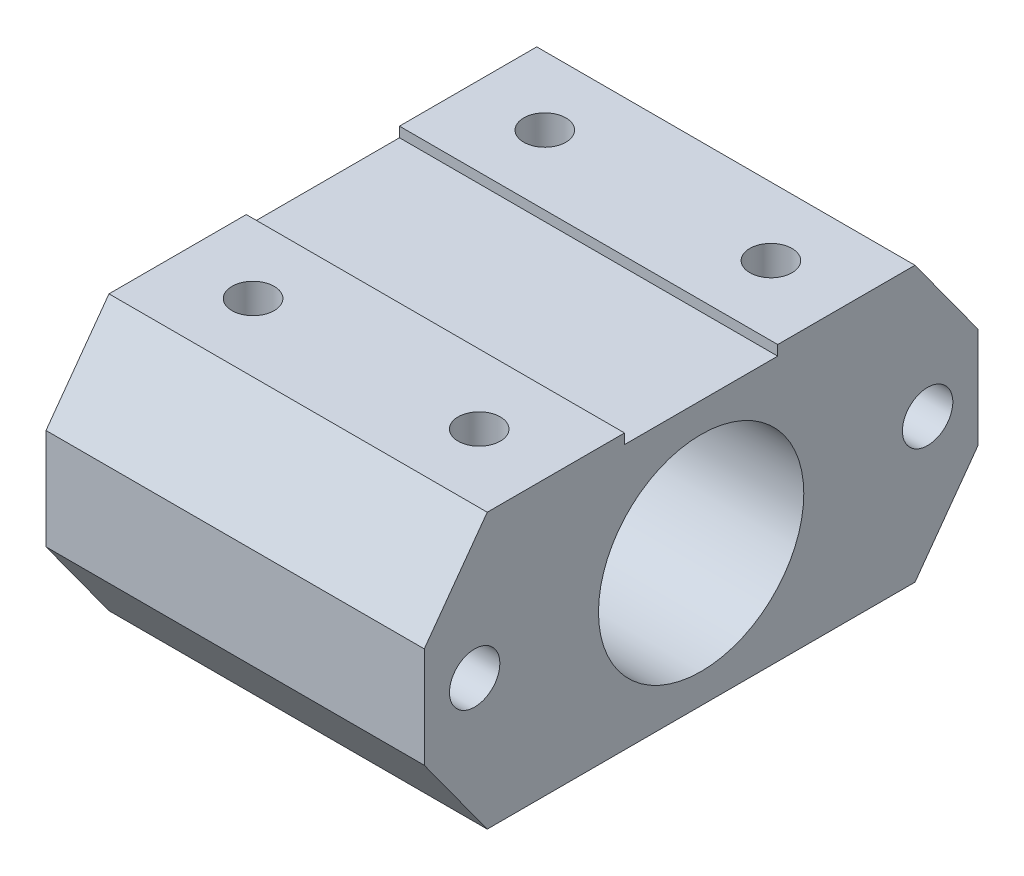
ISO-10303-21;
HEADER;
FILE_DESCRIPTION(('STEP AP214'),'2;1');
FILE_NAME('part.step','',(''),(''),'','','');
FILE_SCHEMA(('AUTOMOTIVE_DESIGN { 1 0 10303 214 1 1 1 1 }'));
ENDSEC;
DATA;
#1=APPLICATION_CONTEXT('core data for automotive mechanical design processes');
#2=APPLICATION_PROTOCOL_DEFINITION('international standard','automotive_design',2000,#1);
#3=PRODUCT_CONTEXT('',#1,'mechanical');
#4=PRODUCT('Part','Part','',(#3));
#5=PRODUCT_RELATED_PRODUCT_CATEGORY('part','',(#4));
#6=PRODUCT_DEFINITION_FORMATION('','',#4);
#7=PRODUCT_DEFINITION_CONTEXT('part definition',#1,'design');
#8=PRODUCT_DEFINITION('design','',#6,#7);
#9=PRODUCT_DEFINITION_SHAPE('','',#8);
#10=(LENGTH_UNIT() NAMED_UNIT(*) SI_UNIT(.MILLI.,.METRE.));
#11=(NAMED_UNIT(*) PLANE_ANGLE_UNIT() SI_UNIT($,.RADIAN.));
#12=(NAMED_UNIT(*) SI_UNIT($,.STERADIAN.) SOLID_ANGLE_UNIT());
#13=UNCERTAINTY_MEASURE_WITH_UNIT(LENGTH_MEASURE(1.E-05),#10,'distance_accuracy_value','');
#14=(GEOMETRIC_REPRESENTATION_CONTEXT(3) GLOBAL_UNCERTAINTY_ASSIGNED_CONTEXT((#13)) GLOBAL_UNIT_ASSIGNED_CONTEXT((#10,
#11,#12)) REPRESENTATION_CONTEXT('',''));
#15=CARTESIAN_POINT('',(0.,0.,0.));
#16=DIRECTION('',(0.,0.,1.));
#17=DIRECTION('',(1.,0.,0.));
#18=AXIS2_PLACEMENT_3D('',#15,#16,#17);
#19=CARTESIAN_POINT('',(0.,10.5,-16.98));
#20=DIRECTION('',(1.,0.,0.));
#21=DIRECTION('',(0.,0.,-1.));
#22=AXIS2_PLACEMENT_3D('',#19,#20,#21);
#23=CYLINDRICAL_SURFACE('',#22,8.15);
#24=CARTESIAN_POINT('',(30.03,10.5,-16.98));
#25=DIRECTION('',(1.,0.,0.));
#26=DIRECTION('',(0.,0.,-1.));
#27=AXIS2_PLACEMENT_3D('',#24,#25,#26);
#28=CIRCLE('',#27,8.15);
#29=CARTESIAN_POINT('',(30.03,10.5,-25.13));
#30=VERTEX_POINT('',#29);
#31=EDGE_CURVE('E216',#30,#30,#28,.T.);
#32=ORIENTED_EDGE('',*,*,#31,.T.);
#33=EDGE_LOOP('',(#32));
#34=FACE_BOUND('',#33,.T.);
#35=CARTESIAN_POINT('',(3.,10.5,-16.98));
#36=DIRECTION('',(-1.,0.,0.));
#37=DIRECTION('',(0.,0.,1.));
#38=AXIS2_PLACEMENT_3D('',#35,#36,#37);
#39=CIRCLE('',#38,8.15);
#40=CARTESIAN_POINT('',(3.,10.5,-8.83));
#41=VERTEX_POINT('',#40);
#42=EDGE_CURVE('E11',#41,#41,#39,.F.);
#43=ORIENTED_EDGE('',*,*,#42,.F.);
#44=EDGE_LOOP('',(#43));
#45=FACE_BOUND('',#44,.T.);
#46=ADVANCED_FACE('F37',(#34,#45),#23,.F.);
#47=CARTESIAN_POINT('',(0.,21.79,0.));
#48=DIRECTION('',(0.,-1.,0.));
#49=DIRECTION('',(0.,0.,-1.));
#50=AXIS2_PLACEMENT_3D('',#47,#48,#49);
#51=PLANE('',#50);
#52=CARTESIAN_POINT('',(6.04,21.79,-28.56));
#53=DIRECTION('',(0.,1.,0.));
#54=DIRECTION('',(0.,0.,-1.));
#55=AXIS2_PLACEMENT_3D('',#52,#53,#54);
#56=CIRCLE('',#55,1.675);
#57=CARTESIAN_POINT('',(6.04,21.79,-30.235));
#58=VERTEX_POINT('',#57);
#59=EDGE_CURVE('E238',#58,#58,#56,.T.);
#60=ORIENTED_EDGE('',*,*,#59,.F.);
#61=EDGE_LOOP('',(#60));
#62=FACE_BOUND('',#61,.T.);
#63=CARTESIAN_POINT('',(23.99,21.79,-28.56));
#64=DIRECTION('',(0.,1.,0.));
#65=DIRECTION('',(0.,0.,1.));
#66=AXIS2_PLACEMENT_3D('',#63,#64,#65);
#67=CIRCLE('',#66,1.675);
#68=CARTESIAN_POINT('',(23.99,21.79,-26.885));
#69=VERTEX_POINT('',#68);
#70=EDGE_CURVE('E144',#69,#69,#67,.T.);
#71=ORIENTED_EDGE('',*,*,#70,.F.);
#72=EDGE_LOOP('',(#71));
#73=FACE_BOUND('',#72,.T.);
#74=DIRECTION('',(0.,0.,1.));
#75=VECTOR('',#74,1.);
#76=CARTESIAN_POINT('',(0.,21.79,0.));
#77=LINE('',#76,#75);
#78=CARTESIAN_POINT('',(0.,21.79,-33.96));
#79=VERTEX_POINT('',#78);
#80=CARTESIAN_POINT('',(0.,21.79,-23.06));
#81=VERTEX_POINT('',#80);
#82=EDGE_CURVE('E248',#79,#81,#77,.T.);
#83=ORIENTED_EDGE('',*,*,#82,.T.);
#84=DIRECTION('',(-1.,0.,0.));
#85=VECTOR('',#84,1.);
#86=CARTESIAN_POINT('',(0.,21.79,-23.06));
#87=LINE('',#86,#85);
#88=CARTESIAN_POINT('',(30.03,21.79,-23.06));
#89=VERTEX_POINT('',#88);
#90=EDGE_CURVE('E203',#89,#81,#87,.T.);
#91=ORIENTED_EDGE('',*,*,#90,.F.);
#92=DIRECTION('',(0.,0.,-1.));
#93=VECTOR('',#92,1.);
#94=CARTESIAN_POINT('',(30.03,21.79,0.));
#95=LINE('',#94,#93);
#96=CARTESIAN_POINT('',(30.03,21.79,-33.96));
#97=VERTEX_POINT('',#96);
#98=EDGE_CURVE('E252',#89,#97,#95,.T.);
#99=ORIENTED_EDGE('',*,*,#98,.T.);
#100=DIRECTION('',(-1.,0.,0.));
#101=VECTOR('',#100,1.);
#102=CARTESIAN_POINT('',(0.,21.79,-33.96));
#103=LINE('',#102,#101);
#104=EDGE_CURVE('E45',#97,#79,#103,.T.);
#105=ORIENTED_EDGE('',*,*,#104,.T.);
#106=EDGE_LOOP('',(#83,#91,#99,#105));
#107=FACE_BOUND('',#106,.T.);
#108=ADVANCED_FACE('F303',(#62,#73,#107),#51,.F.);
#109=CARTESIAN_POINT('',(30.03,21.79,0.));
#110=VERTEX_POINT('',#109);
#111=CARTESIAN_POINT('',(30.03,21.79,-10.9));
#112=VERTEX_POINT('',#111);
#113=EDGE_CURVE('E253',#110,#112,#95,.T.);
#114=ORIENTED_EDGE('',*,*,#113,.T.);
#115=DIRECTION('',(1.,0.,0.));
#116=VECTOR('',#115,1.);
#117=CARTESIAN_POINT('',(0.,21.79,-10.9));
#118=LINE('',#117,#116);
#119=CARTESIAN_POINT('',(0.,21.79,-10.9));
#120=VERTEX_POINT('',#119);
#121=EDGE_CURVE('E198',#120,#112,#118,.T.);
#122=ORIENTED_EDGE('',*,*,#121,.F.);
#123=CARTESIAN_POINT('',(0.,21.79,0.));
#124=VERTEX_POINT('',#123);
#125=EDGE_CURVE('E84',#120,#124,#77,.T.);
#126=ORIENTED_EDGE('',*,*,#125,.T.);
#127=DIRECTION('',(1.,0.,0.));
#128=VECTOR('',#127,1.);
#129=CARTESIAN_POINT('',(0.,21.79,0.));
#130=LINE('',#129,#128);
#131=EDGE_CURVE('E250',#124,#110,#130,.T.);
#132=ORIENTED_EDGE('',*,*,#131,.T.);
#133=EDGE_LOOP('',(#114,#122,#126,#132));
#134=FACE_BOUND('',#133,.T.);
#135=CARTESIAN_POINT('',(23.99,21.79,-5.4));
#136=DIRECTION('',(0.,1.,0.));
#137=DIRECTION('',(0.,0.,-1.));
#138=AXIS2_PLACEMENT_3D('',#135,#136,#137);
#139=CIRCLE('',#138,1.675);
#140=CARTESIAN_POINT('',(23.99,21.79,-7.075));
#141=VERTEX_POINT('',#140);
#142=EDGE_CURVE('E232',#141,#141,#139,.T.);
#143=ORIENTED_EDGE('',*,*,#142,.F.);
#144=EDGE_LOOP('',(#143));
#145=FACE_BOUND('',#144,.T.);
#146=CARTESIAN_POINT('',(6.04,21.79,-5.4));
#147=DIRECTION('',(0.,1.,0.));
#148=DIRECTION('',(0.,0.,1.));
#149=AXIS2_PLACEMENT_3D('',#146,#147,#148);
#150=CIRCLE('',#149,1.675);
#151=CARTESIAN_POINT('',(6.04,21.79,-3.725));
#152=VERTEX_POINT('',#151);
#153=EDGE_CURVE('E226',#152,#152,#150,.T.);
#154=ORIENTED_EDGE('',*,*,#153,.F.);
#155=EDGE_LOOP('',(#154));
#156=FACE_BOUND('',#155,.T.);
#157=ADVANCED_FACE('F309',(#134,#145,#156),#51,.F.);
#158=CARTESIAN_POINT('',(0.,0.,0.));
#159=DIRECTION('',(0.,-1.,0.));
#160=DIRECTION('',(0.,0.,-1.));
#161=AXIS2_PLACEMENT_3D('',#158,#159,#160);
#162=PLANE('',#161);
#163=CARTESIAN_POINT('',(23.99,0.,-5.4));
#164=DIRECTION('',(0.,1.,0.));
#165=DIRECTION('',(0.,0.,-1.));
#166=AXIS2_PLACEMENT_3D('',#163,#164,#165);
#167=CIRCLE('',#166,1.675);
#168=CARTESIAN_POINT('',(23.99,0.,-7.075));
#169=VERTEX_POINT('',#168);
#170=EDGE_CURVE('E229',#169,#169,#167,.T.);
#171=ORIENTED_EDGE('',*,*,#170,.T.);
#172=EDGE_LOOP('',(#171));
#173=FACE_BOUND('',#172,.T.);
#174=CARTESIAN_POINT('',(23.99,0.,-28.56));
#175=DIRECTION('',(0.,1.,0.));
#176=DIRECTION('',(0.,0.,1.));
#177=AXIS2_PLACEMENT_3D('',#174,#175,#176);
#178=CIRCLE('',#177,1.675);
#179=CARTESIAN_POINT('',(23.99,0.,-26.885));
#180=VERTEX_POINT('',#179);
#181=EDGE_CURVE('E241',#180,#180,#178,.T.);
#182=ORIENTED_EDGE('',*,*,#181,.T.);
#183=EDGE_LOOP('',(#182));
#184=FACE_BOUND('',#183,.T.);
#185=DIRECTION('',(0.,0.,1.));
#186=VECTOR('',#185,1.);
#187=CARTESIAN_POINT('',(0.,0.,0.));
#188=LINE('',#187,#186);
#189=CARTESIAN_POINT('',(0.,0.,-33.96));
#190=VERTEX_POINT('',#189);
#191=CARTESIAN_POINT('',(0.,0.,0.));
#192=VERTEX_POINT('',#191);
#193=EDGE_CURVE('E76',#190,#192,#188,.T.);
#194=ORIENTED_EDGE('',*,*,#193,.F.);
#195=DIRECTION('',(-1.,0.,0.));
#196=VECTOR('',#195,1.);
#197=CARTESIAN_POINT('',(0.,0.,-33.96));
#198=LINE('',#197,#196);
#199=CARTESIAN_POINT('',(30.03,0.,-33.96));
#200=VERTEX_POINT('',#199);
#201=EDGE_CURVE('E257',#200,#190,#198,.T.);
#202=ORIENTED_EDGE('',*,*,#201,.F.);
#203=DIRECTION('',(0.,0.,-1.));
#204=VECTOR('',#203,1.);
#205=CARTESIAN_POINT('',(30.03,0.,0.));
#206=LINE('',#205,#204);
#207=CARTESIAN_POINT('',(30.03,0.,0.));
#208=VERTEX_POINT('',#207);
#209=EDGE_CURVE('E150',#208,#200,#206,.T.);
#210=ORIENTED_EDGE('',*,*,#209,.F.);
#211=DIRECTION('',(1.,0.,0.));
#212=VECTOR('',#211,1.);
#213=CARTESIAN_POINT('',(0.,0.,0.));
#214=LINE('',#213,#212);
#215=EDGE_CURVE('E143',#192,#208,#214,.T.);
#216=ORIENTED_EDGE('',*,*,#215,.F.);
#217=EDGE_LOOP('',(#194,#202,#210,#216));
#218=FACE_BOUND('',#217,.T.);
#219=CARTESIAN_POINT('',(6.04,0.,-28.56));
#220=DIRECTION('',(0.,1.,0.));
#221=DIRECTION('',(0.,0.,-1.));
#222=AXIS2_PLACEMENT_3D('',#219,#220,#221);
#223=CIRCLE('',#222,1.675);
#224=CARTESIAN_POINT('',(6.04,0.,-30.235));
#225=VERTEX_POINT('',#224);
#226=EDGE_CURVE('E235',#225,#225,#223,.T.);
#227=ORIENTED_EDGE('',*,*,#226,.T.);
#228=EDGE_LOOP('',(#227));
#229=FACE_BOUND('',#228,.T.);
#230=CARTESIAN_POINT('',(6.04,0.,-5.4));
#231=DIRECTION('',(0.,1.,0.));
#232=DIRECTION('',(0.,0.,1.));
#233=AXIS2_PLACEMENT_3D('',#230,#231,#232);
#234=CIRCLE('',#233,1.675);
#235=CARTESIAN_POINT('',(6.04,0.,-3.725));
#236=VERTEX_POINT('',#235);
#237=EDGE_CURVE('E225',#236,#236,#234,.T.);
#238=ORIENTED_EDGE('',*,*,#237,.T.);
#239=EDGE_LOOP('',(#238));
#240=FACE_BOUND('',#239,.T.);
#241=ADVANCED_FACE('F147',(#173,#184,#218,#229,#240),#162,.T.);
#242=CARTESIAN_POINT('',(0.,21.79,0.));
#243=DIRECTION('',(1.,0.,0.));
#244=DIRECTION('',(0.,0.,-1.));
#245=AXIS2_PLACEMENT_3D('',#242,#243,#244);
#246=PLANE('',#245);
#247=DIRECTION('',(0.,0.,1.));
#248=VECTOR('',#247,1.);
#249=CARTESIAN_POINT('',(0.,20.99,-23.06));
#250=LINE('',#249,#248);
#251=CARTESIAN_POINT('',(0.,20.99,-23.06));
#252=VERTEX_POINT('',#251);
#253=CARTESIAN_POINT('',(0.,20.99,-10.9));
#254=VERTEX_POINT('',#253);
#255=EDGE_CURVE('E201',#252,#254,#250,.T.);
#256=ORIENTED_EDGE('',*,*,#255,.F.);
#257=DIRECTION('',(0.,1.,0.));
#258=VECTOR('',#257,1.);
#259=CARTESIAN_POINT('',(0.,20.99,-23.06));
#260=LINE('',#259,#258);
#261=EDGE_CURVE('E213',#252,#81,#260,.T.);
#262=ORIENTED_EDGE('',*,*,#261,.T.);
#263=ORIENTED_EDGE('',*,*,#82,.F.);
#264=DIRECTION('',(0.,-0.809547668944308,-0.587054147167736));
#265=VECTOR('',#264,1.);
#266=CARTESIAN_POINT('',(0.,21.79,-33.96));
#267=LINE('',#266,#265);
#268=CARTESIAN_POINT('',(0.,14.895,-38.96));
#269=VERTEX_POINT('',#268);
#270=EDGE_CURVE('E183',#79,#269,#267,.T.);
#271=ORIENTED_EDGE('',*,*,#270,.T.);
#272=DIRECTION('',(0.,-1.,0.));
#273=VECTOR('',#272,1.);
#274=CARTESIAN_POINT('',(0.,14.895,-38.96));
#275=LINE('',#274,#273);
#276=CARTESIAN_POINT('',(0.,6.895,-38.96));
#277=VERTEX_POINT('',#276);
#278=EDGE_CURVE('E186',#269,#277,#275,.T.);
#279=ORIENTED_EDGE('',*,*,#278,.T.);
#280=DIRECTION('',(0.,-0.809547668944308,0.587054147167735));
#281=VECTOR('',#280,1.);
#282=CARTESIAN_POINT('',(0.,0.,-33.96));
#283=LINE('',#282,#281);
#284=EDGE_CURVE('E142',#277,#190,#283,.T.);
#285=ORIENTED_EDGE('',*,*,#284,.T.);
#286=ORIENTED_EDGE('',*,*,#193,.T.);
#287=DIRECTION('',(0.,0.809547668944308,0.587054147167735));
#288=VECTOR('',#287,1.);
#289=CARTESIAN_POINT('',(0.,6.895,5.));
#290=LINE('',#289,#288);
#291=CARTESIAN_POINT('',(0.,6.895,5.));
#292=VERTEX_POINT('',#291);
#293=EDGE_CURVE('E139',#192,#292,#290,.T.);
#294=ORIENTED_EDGE('',*,*,#293,.T.);
#295=DIRECTION('',(0.,1.,0.));
#296=VECTOR('',#295,1.);
#297=CARTESIAN_POINT('',(0.,14.895,5.));
#298=LINE('',#297,#296);
#299=CARTESIAN_POINT('',(0.,14.895,5.));
#300=VERTEX_POINT('',#299);
#301=EDGE_CURVE('E159',#292,#300,#298,.T.);
#302=ORIENTED_EDGE('',*,*,#301,.T.);
#303=DIRECTION('',(0.,0.809547668944308,-0.587054147167736));
#304=VECTOR('',#303,1.);
#305=CARTESIAN_POINT('',(0.,14.895,5.));
#306=LINE('',#305,#304);
#307=EDGE_CURVE('E162',#300,#124,#306,.T.);
#308=ORIENTED_EDGE('',*,*,#307,.T.);
#309=ORIENTED_EDGE('',*,*,#125,.F.);
#310=DIRECTION('',(0.,1.,0.));
#311=VECTOR('',#310,1.);
#312=CARTESIAN_POINT('',(0.,20.99,-10.9));
#313=LINE('',#312,#311);
#314=EDGE_CURVE('E210',#254,#120,#313,.T.);
#315=ORIENTED_EDGE('',*,*,#314,.F.);
#316=EDGE_LOOP('',(#256,#262,#263,#271,#279,#285,#286,#294,#302,#308,#309,#315));
#317=FACE_BOUND('',#316,.T.);
#318=CARTESIAN_POINT('',(0.,10.5,-16.98));
#319=DIRECTION('',(-1.,0.,0.));
#320=DIRECTION('',(0.,0.,1.));
#321=AXIS2_PLACEMENT_3D('',#318,#319,#320);
#322=CIRCLE('',#321,4.75);
#323=CARTESIAN_POINT('',(0.,10.5,-12.23));
#324=VERTEX_POINT('',#323);
#325=EDGE_CURVE('E194',#324,#324,#322,.T.);
#326=ORIENTED_EDGE('',*,*,#325,.F.);
#327=EDGE_LOOP('',(#326));
#328=FACE_BOUND('',#327,.T.);
#329=ADVANCED_FACE('F39',(#317,#328),#246,.F.);
#330=CARTESIAN_POINT('',(30.03,21.79,0.));
#331=DIRECTION('',(-1.,0.,0.));
#332=DIRECTION('',(0.,0.,1.));
#333=AXIS2_PLACEMENT_3D('',#330,#331,#332);
#334=PLANE('',#333);
#335=CARTESIAN_POINT('',(30.03,10.895,0.999999999999997));
#336=DIRECTION('',(1.,0.,0.));
#337=DIRECTION('',(0.,0.,-1.));
#338=AXIS2_PLACEMENT_3D('',#335,#336,#337);
#339=CIRCLE('',#338,2.);
#340=CARTESIAN_POINT('',(30.03,10.895,-1.));
#341=VERTEX_POINT('',#340);
#342=EDGE_CURVE('E165',#341,#341,#339,.T.);
#343=ORIENTED_EDGE('',*,*,#342,.F.);
#344=EDGE_LOOP('',(#343));
#345=FACE_BOUND('',#344,.T.);
#346=CARTESIAN_POINT('',(30.03,10.895,-34.96));
#347=DIRECTION('',(1.,0.,0.));
#348=DIRECTION('',(0.,0.,1.));
#349=AXIS2_PLACEMENT_3D('',#346,#347,#348);
#350=CIRCLE('',#349,2.);
#351=CARTESIAN_POINT('',(30.03,10.895,-32.96));
#352=VERTEX_POINT('',#351);
#353=EDGE_CURVE('E271',#352,#352,#350,.T.);
#354=ORIENTED_EDGE('',*,*,#353,.F.);
#355=EDGE_LOOP('',(#354));
#356=FACE_BOUND('',#355,.T.);
#357=ORIENTED_EDGE('',*,*,#98,.F.);
#358=DIRECTION('',(0.,1.,0.));
#359=VECTOR('',#358,1.);
#360=CARTESIAN_POINT('',(30.03,20.99,-23.06));
#361=LINE('',#360,#359);
#362=CARTESIAN_POINT('',(30.03,20.99,-23.06));
#363=VERTEX_POINT('',#362);
#364=EDGE_CURVE('E217',#363,#89,#361,.T.);
#365=ORIENTED_EDGE('',*,*,#364,.F.);
#366=DIRECTION('',(0.,0.,-1.));
#367=VECTOR('',#366,1.);
#368=CARTESIAN_POINT('',(30.03,20.99,-23.06));
#369=LINE('',#368,#367);
#370=CARTESIAN_POINT('',(30.03,20.99,-10.9));
#371=VERTEX_POINT('',#370);
#372=EDGE_CURVE('E205',#371,#363,#369,.T.);
#373=ORIENTED_EDGE('',*,*,#372,.F.);
#374=DIRECTION('',(0.,1.,0.));
#375=VECTOR('',#374,1.);
#376=CARTESIAN_POINT('',(30.03,20.99,-10.9));
#377=LINE('',#376,#375);
#378=EDGE_CURVE('E219',#371,#112,#377,.T.);
#379=ORIENTED_EDGE('',*,*,#378,.T.);
#380=ORIENTED_EDGE('',*,*,#113,.F.);
#381=DIRECTION('',(0.,-0.809547668944308,0.587054147167736));
#382=VECTOR('',#381,1.);
#383=CARTESIAN_POINT('',(30.03,14.895,5.));
#384=LINE('',#383,#382);
#385=CARTESIAN_POINT('',(30.03,14.895,5.));
#386=VERTEX_POINT('',#385);
#387=EDGE_CURVE('E168',#110,#386,#384,.T.);
#388=ORIENTED_EDGE('',*,*,#387,.T.);
#389=DIRECTION('',(0.,-1.,0.));
#390=VECTOR('',#389,1.);
#391=CARTESIAN_POINT('',(30.03,14.895,5.));
#392=LINE('',#391,#390);
#393=CARTESIAN_POINT('',(30.03,6.895,5.));
#394=VERTEX_POINT('',#393);
#395=EDGE_CURVE('E268',#386,#394,#392,.T.);
#396=ORIENTED_EDGE('',*,*,#395,.T.);
#397=DIRECTION('',(0.,-0.809547668944308,-0.587054147167736));
#398=VECTOR('',#397,1.);
#399=CARTESIAN_POINT('',(30.03,6.895,5.));
#400=LINE('',#399,#398);
#401=EDGE_CURVE('E175',#394,#208,#400,.T.);
#402=ORIENTED_EDGE('',*,*,#401,.T.);
#403=ORIENTED_EDGE('',*,*,#209,.T.);
#404=DIRECTION('',(0.,0.809547668944308,-0.587054147167735));
#405=VECTOR('',#404,1.);
#406=CARTESIAN_POINT('',(30.03,0.,-33.96));
#407=LINE('',#406,#405);
#408=CARTESIAN_POINT('',(30.03,6.895,-38.96));
#409=VERTEX_POINT('',#408);
#410=EDGE_CURVE('E179',#200,#409,#407,.T.);
#411=ORIENTED_EDGE('',*,*,#410,.T.);
#412=DIRECTION('',(0.,1.,0.));
#413=VECTOR('',#412,1.);
#414=CARTESIAN_POINT('',(30.03,14.895,-38.96));
#415=LINE('',#414,#413);
#416=CARTESIAN_POINT('',(30.03,14.895,-38.96));
#417=VERTEX_POINT('',#416);
#418=EDGE_CURVE('E177',#409,#417,#415,.T.);
#419=ORIENTED_EDGE('',*,*,#418,.T.);
#420=DIRECTION('',(0.,0.809547668944308,0.587054147167736));
#421=VECTOR('',#420,1.);
#422=CARTESIAN_POINT('',(30.03,21.79,-33.96));
#423=LINE('',#422,#421);
#424=EDGE_CURVE('E182',#417,#97,#423,.T.);
#425=ORIENTED_EDGE('',*,*,#424,.T.);
#426=EDGE_LOOP('',(#357,#365,#373,#379,#380,#388,#396,#402,#403,#411,#419,#425));
#427=FACE_BOUND('',#426,.T.);
#428=ORIENTED_EDGE('',*,*,#31,.F.);
#429=EDGE_LOOP('',(#428));
#430=FACE_BOUND('',#429,.T.);
#431=ADVANCED_FACE('F264',(#345,#356,#427,#430),#334,.F.);
#432=CARTESIAN_POINT('',(23.99,21.79,-28.56));
#433=DIRECTION('',(0.,-1.,0.));
#434=DIRECTION('',(0.,0.,-1.));
#435=AXIS2_PLACEMENT_3D('',#432,#433,#434);
#436=CYLINDRICAL_SURFACE('',#435,1.675);
#437=ORIENTED_EDGE('',*,*,#70,.T.);
#438=EDGE_LOOP('',(#437));
#439=FACE_BOUND('',#438,.T.);
#440=ORIENTED_EDGE('',*,*,#181,.F.);
#441=EDGE_LOOP('',(#440));
#442=FACE_BOUND('',#441,.T.);
#443=ADVANCED_FACE('F284',(#439,#442),#436,.F.);
#444=CARTESIAN_POINT('',(6.04,21.79,-28.56));
#445=DIRECTION('',(0.,-1.,0.));
#446=DIRECTION('',(0.,0.,-1.));
#447=AXIS2_PLACEMENT_3D('',#444,#445,#446);
#448=CYLINDRICAL_SURFACE('',#447,1.675);
#449=ORIENTED_EDGE('',*,*,#59,.T.);
#450=EDGE_LOOP('',(#449));
#451=FACE_BOUND('',#450,.T.);
#452=ORIENTED_EDGE('',*,*,#226,.F.);
#453=EDGE_LOOP('',(#452));
#454=FACE_BOUND('',#453,.T.);
#455=ADVANCED_FACE('F325',(#451,#454),#448,.F.);
#456=CARTESIAN_POINT('',(23.99,21.79,-5.4));
#457=DIRECTION('',(0.,-1.,0.));
#458=DIRECTION('',(0.,0.,-1.));
#459=AXIS2_PLACEMENT_3D('',#456,#457,#458);
#460=CYLINDRICAL_SURFACE('',#459,1.675);
#461=ORIENTED_EDGE('',*,*,#142,.T.);
#462=EDGE_LOOP('',(#461));
#463=FACE_BOUND('',#462,.T.);
#464=ORIENTED_EDGE('',*,*,#170,.F.);
#465=EDGE_LOOP('',(#464));
#466=FACE_BOUND('',#465,.T.);
#467=ADVANCED_FACE('F321',(#463,#466),#460,.F.);
#468=CARTESIAN_POINT('',(6.04,21.79,-5.4));
#469=DIRECTION('',(0.,-1.,0.));
#470=DIRECTION('',(0.,0.,-1.));
#471=AXIS2_PLACEMENT_3D('',#468,#469,#470);
#472=CYLINDRICAL_SURFACE('',#471,1.675);
#473=ORIENTED_EDGE('',*,*,#153,.T.);
#474=EDGE_LOOP('',(#473));
#475=FACE_BOUND('',#474,.T.);
#476=ORIENTED_EDGE('',*,*,#237,.F.);
#477=EDGE_LOOP('',(#476));
#478=FACE_BOUND('',#477,.T.);
#479=ADVANCED_FACE('F317',(#475,#478),#472,.F.);
#480=CARTESIAN_POINT('',(0.,20.99,-23.06));
#481=DIRECTION('',(0.,0.,-1.));
#482=DIRECTION('',(-1.,0.,0.));
#483=AXIS2_PLACEMENT_3D('',#480,#481,#482);
#484=PLANE('',#483);
#485=ORIENTED_EDGE('',*,*,#90,.T.);
#486=ORIENTED_EDGE('',*,*,#261,.F.);
#487=DIRECTION('',(-1.,0.,0.));
#488=VECTOR('',#487,1.);
#489=CARTESIAN_POINT('',(0.,20.99,-23.06));
#490=LINE('',#489,#488);
#491=EDGE_CURVE('E207',#363,#252,#490,.T.);
#492=ORIENTED_EDGE('',*,*,#491,.F.);
#493=ORIENTED_EDGE('',*,*,#364,.T.);
#494=EDGE_LOOP('',(#485,#486,#492,#493));
#495=FACE_BOUND('',#494,.T.);
#496=ADVANCED_FACE('F320',(#495),#484,.F.);
#497=CARTESIAN_POINT('',(0.,20.99,-10.9));
#498=DIRECTION('',(0.,0.,1.));
#499=DIRECTION('',(1.,0.,0.));
#500=AXIS2_PLACEMENT_3D('',#497,#498,#499);
#501=PLANE('',#500);
#502=ORIENTED_EDGE('',*,*,#121,.T.);
#503=ORIENTED_EDGE('',*,*,#378,.F.);
#504=DIRECTION('',(1.,0.,0.));
#505=VECTOR('',#504,1.);
#506=CARTESIAN_POINT('',(0.,20.99,-10.9));
#507=LINE('',#506,#505);
#508=EDGE_CURVE('E52',#254,#371,#507,.T.);
#509=ORIENTED_EDGE('',*,*,#508,.F.);
#510=ORIENTED_EDGE('',*,*,#314,.T.);
#511=EDGE_LOOP('',(#502,#503,#509,#510));
#512=FACE_BOUND('',#511,.T.);
#513=ADVANCED_FACE('F315',(#512),#501,.F.);
#514=CARTESIAN_POINT('',(0.,20.99,0.));
#515=DIRECTION('',(0.,1.,0.));
#516=DIRECTION('',(0.,0.,1.));
#517=AXIS2_PLACEMENT_3D('',#514,#515,#516);
#518=PLANE('',#517);
#519=ORIENTED_EDGE('',*,*,#255,.T.);
#520=ORIENTED_EDGE('',*,*,#508,.T.);
#521=ORIENTED_EDGE('',*,*,#372,.T.);
#522=ORIENTED_EDGE('',*,*,#491,.T.);
#523=EDGE_LOOP('',(#519,#520,#521,#522));
#524=FACE_BOUND('',#523,.T.);
#525=ADVANCED_FACE('F380',(#524),#518,.T.);
#526=CARTESIAN_POINT('',(3.,10.5,-16.98));
#527=DIRECTION('',(-1.,0.,0.));
#528=DIRECTION('',(0.,0.,1.));
#529=AXIS2_PLACEMENT_3D('',#526,#527,#528);
#530=PLANE('',#529);
#531=CARTESIAN_POINT('',(3.,10.5,-16.98));
#532=DIRECTION('',(-1.,0.,0.));
#533=DIRECTION('',(0.,0.,1.));
#534=AXIS2_PLACEMENT_3D('',#531,#532,#533);
#535=CIRCLE('',#534,4.75);
#536=CARTESIAN_POINT('',(3.,10.5,-12.23));
#537=VERTEX_POINT('',#536);
#538=EDGE_CURVE('E195',#537,#537,#535,.T.);
#539=ORIENTED_EDGE('',*,*,#538,.T.);
#540=EDGE_LOOP('',(#539));
#541=FACE_BOUND('',#540,.T.);
#542=ORIENTED_EDGE('',*,*,#42,.T.);
#543=EDGE_LOOP('',(#542));
#544=FACE_BOUND('',#543,.T.);
#545=ADVANCED_FACE('F387',(#541,#544),#530,.F.);
#546=CARTESIAN_POINT('',(3.,10.5,-16.98));
#547=DIRECTION('',(-1.,0.,0.));
#548=DIRECTION('',(0.,0.,1.));
#549=AXIS2_PLACEMENT_3D('',#546,#547,#548);
#550=CYLINDRICAL_SURFACE('',#549,4.75);
#551=ORIENTED_EDGE('',*,*,#538,.F.);
#552=EDGE_LOOP('',(#551));
#553=FACE_BOUND('',#552,.T.);
#554=ORIENTED_EDGE('',*,*,#325,.T.);
#555=EDGE_LOOP('',(#554));
#556=FACE_BOUND('',#555,.T.);
#557=ADVANCED_FACE('F394',(#553,#556),#550,.F.);
#558=CARTESIAN_POINT('',(52.3862988886801,0.,-33.96));
#559=DIRECTION('',(0.,-0.587054147167735,-0.809547668944308));
#560=DIRECTION('',(0.,0.809547668944308,-0.587054147167735));
#561=AXIS2_PLACEMENT_3D('',#558,#559,#560);
#562=PLANE('',#561);
#563=ORIENTED_EDGE('',*,*,#410,.F.);
#564=ORIENTED_EDGE('',*,*,#201,.T.);
#565=ORIENTED_EDGE('',*,*,#284,.F.);
#566=DIRECTION('',(-1.,0.,0.));
#567=VECTOR('',#566,1.);
#568=CARTESIAN_POINT('',(52.3862988886801,6.895,-38.96));
#569=LINE('',#568,#567);
#570=EDGE_CURVE('E180',#409,#277,#569,.T.);
#571=ORIENTED_EDGE('',*,*,#570,.F.);
#572=EDGE_LOOP('',(#563,#564,#565,#571));
#573=FACE_BOUND('',#572,.T.);
#574=ADVANCED_FACE('F260',(#573),#562,.T.);
#575=CARTESIAN_POINT('',(52.3862988886801,14.895,-38.96));
#576=DIRECTION('',(0.,0.,-1.));
#577=DIRECTION('',(0.,1.,0.));
#578=AXIS2_PLACEMENT_3D('',#575,#576,#577);
#579=PLANE('',#578);
#580=ORIENTED_EDGE('',*,*,#418,.F.);
#581=ORIENTED_EDGE('',*,*,#570,.T.);
#582=ORIENTED_EDGE('',*,*,#278,.F.);
#583=DIRECTION('',(-1.,0.,0.));
#584=VECTOR('',#583,1.);
#585=CARTESIAN_POINT('',(52.3862988886801,14.895,-38.96));
#586=LINE('',#585,#584);
#587=EDGE_CURVE('E189',#417,#269,#586,.T.);
#588=ORIENTED_EDGE('',*,*,#587,.F.);
#589=EDGE_LOOP('',(#580,#581,#582,#588));
#590=FACE_BOUND('',#589,.T.);
#591=ADVANCED_FACE('F409',(#590),#579,.T.);
#592=CARTESIAN_POINT('',(52.3862988886801,21.79,-33.96));
#593=DIRECTION('',(0.,0.587054147167736,-0.809547668944308));
#594=DIRECTION('',(0.,0.809547668944308,0.587054147167736));
#595=AXIS2_PLACEMENT_3D('',#592,#593,#594);
#596=PLANE('',#595);
#597=ORIENTED_EDGE('',*,*,#424,.F.);
#598=ORIENTED_EDGE('',*,*,#587,.T.);
#599=ORIENTED_EDGE('',*,*,#270,.F.);
#600=ORIENTED_EDGE('',*,*,#104,.F.);
#601=EDGE_LOOP('',(#597,#598,#599,#600));
#602=FACE_BOUND('',#601,.T.);
#603=ADVANCED_FACE('F416',(#602),#596,.T.);
#604=CARTESIAN_POINT('',(52.3862988886801,14.895,5.));
#605=DIRECTION('',(0.,0.587054147167736,0.809547668944308));
#606=DIRECTION('',(0.,-0.809547668944308,0.587054147167736));
#607=AXIS2_PLACEMENT_3D('',#604,#605,#606);
#608=PLANE('',#607);
#609=ORIENTED_EDGE('',*,*,#387,.F.);
#610=ORIENTED_EDGE('',*,*,#131,.F.);
#611=ORIENTED_EDGE('',*,*,#307,.F.);
#612=DIRECTION('',(-1.,0.,0.));
#613=VECTOR('',#612,1.);
#614=CARTESIAN_POINT('',(52.3862988886801,14.895,5.));
#615=LINE('',#614,#613);
#616=EDGE_CURVE('E173',#386,#300,#615,.T.);
#617=ORIENTED_EDGE('',*,*,#616,.F.);
#618=EDGE_LOOP('',(#609,#610,#611,#617));
#619=FACE_BOUND('',#618,.T.);
#620=ADVANCED_FACE('F424',(#619),#608,.T.);
#621=CARTESIAN_POINT('',(52.3862988886801,14.895,5.));
#622=DIRECTION('',(0.,0.,1.));
#623=DIRECTION('',(0.,-1.,0.));
#624=AXIS2_PLACEMENT_3D('',#621,#622,#623);
#625=PLANE('',#624);
#626=ORIENTED_EDGE('',*,*,#395,.F.);
#627=ORIENTED_EDGE('',*,*,#616,.T.);
#628=ORIENTED_EDGE('',*,*,#301,.F.);
#629=DIRECTION('',(-1.,0.,0.));
#630=VECTOR('',#629,1.);
#631=CARTESIAN_POINT('',(52.3862988886801,6.895,5.));
#632=LINE('',#631,#630);
#633=EDGE_CURVE('E157',#394,#292,#632,.T.);
#634=ORIENTED_EDGE('',*,*,#633,.F.);
#635=EDGE_LOOP('',(#626,#627,#628,#634));
#636=FACE_BOUND('',#635,.T.);
#637=ADVANCED_FACE('F298',(#636),#625,.T.);
#638=CARTESIAN_POINT('',(52.3862988886801,6.895,5.));
#639=DIRECTION('',(0.,-0.587054147167735,0.809547668944308));
#640=DIRECTION('',(0.,-0.809547668944308,-0.587054147167736));
#641=AXIS2_PLACEMENT_3D('',#638,#639,#640);
#642=PLANE('',#641);
#643=ORIENTED_EDGE('',*,*,#401,.F.);
#644=ORIENTED_EDGE('',*,*,#633,.T.);
#645=ORIENTED_EDGE('',*,*,#293,.F.);
#646=ORIENTED_EDGE('',*,*,#215,.T.);
#647=EDGE_LOOP('',(#643,#644,#645,#646));
#648=FACE_BOUND('',#647,.T.);
#649=ADVANCED_FACE('F155',(#648),#642,.T.);
#650=CARTESIAN_POINT('',(20.03,10.895,-34.96));
#651=DIRECTION('',(1.,0.,0.));
#652=DIRECTION('',(0.,0.,-1.));
#653=AXIS2_PLACEMENT_3D('',#650,#651,#652);
#654=CYLINDRICAL_SURFACE('',#653,2.);
#655=CARTESIAN_POINT('',(20.03,10.895,-34.96));
#656=DIRECTION('',(1.,0.,0.));
#657=DIRECTION('',(0.,0.,1.));
#658=AXIS2_PLACEMENT_3D('',#655,#656,#657);
#659=CIRCLE('',#658,2.);
#660=CARTESIAN_POINT('',(20.03,10.895,-32.96));
#661=VERTEX_POINT('',#660);
#662=EDGE_CURVE('E274',#661,#661,#659,.T.);
#663=ORIENTED_EDGE('',*,*,#662,.F.);
#664=EDGE_LOOP('',(#663));
#665=FACE_BOUND('',#664,.T.);
#666=ORIENTED_EDGE('',*,*,#353,.T.);
#667=EDGE_LOOP('',(#666));
#668=FACE_BOUND('',#667,.T.);
#669=ADVANCED_FACE('F287',(#665,#668),#654,.F.);
#670=CARTESIAN_POINT('',(20.03,10.895,-34.96));
#671=DIRECTION('',(-1.,0.,0.));
#672=DIRECTION('',(0.,0.,1.));
#673=AXIS2_PLACEMENT_3D('',#670,#671,#672);
#674=PLANE('',#673);
#675=ORIENTED_EDGE('',*,*,#662,.T.);
#676=EDGE_LOOP('',(#675));
#677=FACE_BOUND('',#676,.T.);
#678=ADVANCED_FACE('F289',(#677),#674,.F.);
#679=CARTESIAN_POINT('',(20.03,10.895,0.999999999999997));
#680=DIRECTION('',(1.,0.,0.));
#681=DIRECTION('',(0.,0.,-1.));
#682=AXIS2_PLACEMENT_3D('',#679,#680,#681);
#683=CYLINDRICAL_SURFACE('',#682,2.);
#684=CARTESIAN_POINT('',(20.03,10.895,0.999999999999997));
#685=DIRECTION('',(1.,0.,0.));
#686=DIRECTION('',(0.,0.,-1.));
#687=AXIS2_PLACEMENT_3D('',#684,#685,#686);
#688=CIRCLE('',#687,2.);
#689=CARTESIAN_POINT('',(20.03,10.895,-1.));
#690=VERTEX_POINT('',#689);
#691=EDGE_CURVE('E160',#690,#690,#688,.T.);
#692=ORIENTED_EDGE('',*,*,#691,.F.);
#693=EDGE_LOOP('',(#692));
#694=FACE_BOUND('',#693,.T.);
#695=ORIENTED_EDGE('',*,*,#342,.T.);
#696=EDGE_LOOP('',(#695));
#697=FACE_BOUND('',#696,.T.);
#698=ADVANCED_FACE('F280',(#694,#697),#683,.F.);
#699=CARTESIAN_POINT('',(20.03,10.895,0.999999999999997));
#700=DIRECTION('',(1.,0.,0.));
#701=DIRECTION('',(0.,0.,-1.));
#702=AXIS2_PLACEMENT_3D('',#699,#700,#701);
#703=PLANE('',#702);
#704=ORIENTED_EDGE('',*,*,#691,.T.);
#705=EDGE_LOOP('',(#704));
#706=FACE_BOUND('',#705,.T.);
#707=ADVANCED_FACE('F463',(#706),#703,.T.);
#708=CLOSED_SHELL('',(#46,#108,#157,#241,#329,#431,#443,#455,#467,#479,#496,#513,#525,#545,#557,
#574,#591,#603,#620,#637,#649,#669,#678,#698,#707));
#709=MANIFOLD_SOLID_BREP('B2',#708);
#710=ADVANCED_BREP_SHAPE_REPRESENTATION('',(#18,#709),#14);
#711=SHAPE_DEFINITION_REPRESENTATION(#9,#710);
ENDSEC;
END-ISO-10303-21;
